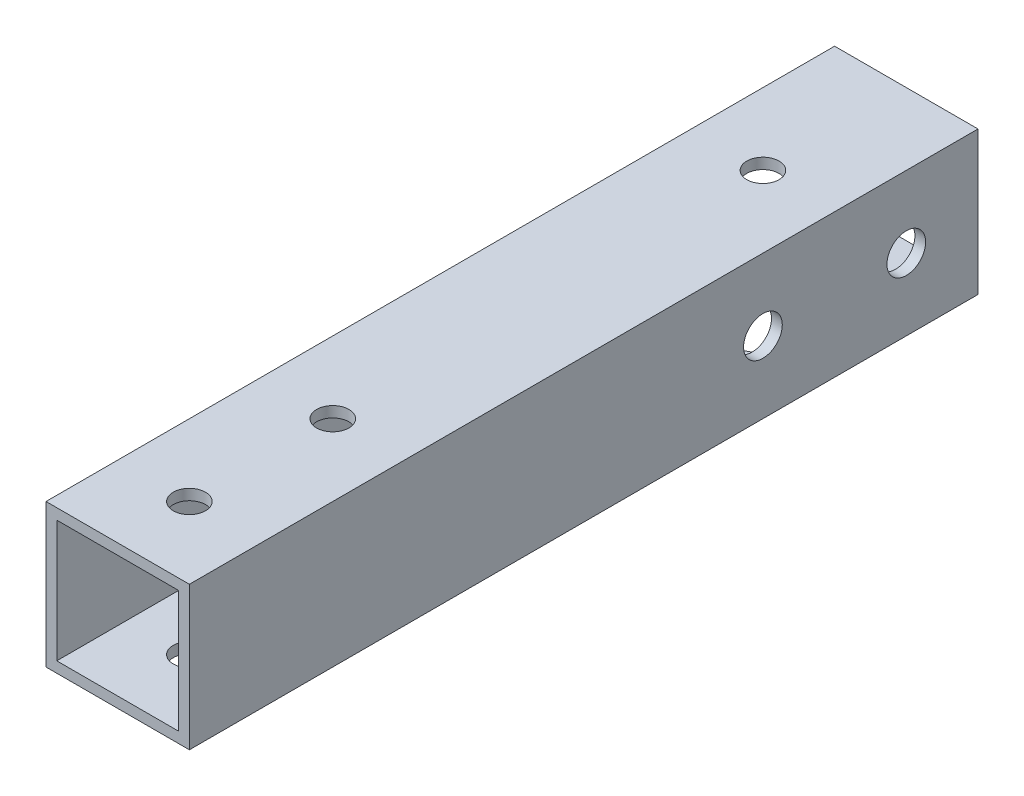
ISO-10303-21;
HEADER;
FILE_DESCRIPTION(('STEP AP214'),'2;1');
FILE_NAME('part.step','',(''),(''),'','','');
FILE_SCHEMA(('AUTOMOTIVE_DESIGN { 1 0 10303 214 1 1 1 1 }'));
ENDSEC;
DATA;
#1=APPLICATION_CONTEXT('core data for automotive mechanical design processes');
#2=APPLICATION_PROTOCOL_DEFINITION('international standard','automotive_design',2000,#1);
#3=PRODUCT_CONTEXT('',#1,'mechanical');
#4=PRODUCT('Part','Part','',(#3));
#5=PRODUCT_RELATED_PRODUCT_CATEGORY('part','',(#4));
#6=PRODUCT_DEFINITION_FORMATION('','',#4);
#7=PRODUCT_DEFINITION_CONTEXT('part definition',#1,'design');
#8=PRODUCT_DEFINITION('design','',#6,#7);
#9=PRODUCT_DEFINITION_SHAPE('','',#8);
#10=(LENGTH_UNIT() NAMED_UNIT(*) SI_UNIT(.MILLI.,.METRE.));
#11=(NAMED_UNIT(*) PLANE_ANGLE_UNIT() SI_UNIT($,.RADIAN.));
#12=(NAMED_UNIT(*) SI_UNIT($,.STERADIAN.) SOLID_ANGLE_UNIT());
#13=UNCERTAINTY_MEASURE_WITH_UNIT(LENGTH_MEASURE(1.E-05),#10,'distance_accuracy_value','');
#14=(GEOMETRIC_REPRESENTATION_CONTEXT(3) GLOBAL_UNCERTAINTY_ASSIGNED_CONTEXT((#13)) GLOBAL_UNIT_ASSIGNED_CONTEXT((#10,
#11,#12)) REPRESENTATION_CONTEXT('',''));
#15=CARTESIAN_POINT('',(0.,0.,0.));
#16=DIRECTION('',(0.,0.,1.));
#17=DIRECTION('',(1.,0.,0.));
#18=AXIS2_PLACEMENT_3D('',#15,#16,#17);
#19=CARTESIAN_POINT('',(0.,0.,110.));
#20=DIRECTION('',(0.,0.,-1.));
#21=DIRECTION('',(-1.,0.,0.));
#22=AXIS2_PLACEMENT_3D('',#19,#20,#21);
#23=PLANE('',#22);
#24=DIRECTION('',(0.,1.,0.));
#25=VECTOR('',#24,1.);
#26=CARTESIAN_POINT('',(10.,-10.,110.));
#27=LINE('',#26,#25);
#28=CARTESIAN_POINT('',(10.,-10.,110.));
#29=VERTEX_POINT('',#28);
#30=CARTESIAN_POINT('',(10.,10.,110.));
#31=VERTEX_POINT('',#30);
#32=EDGE_CURVE('E146',#29,#31,#27,.T.);
#33=ORIENTED_EDGE('',*,*,#32,.T.);
#34=DIRECTION('',(-1.,0.,0.));
#35=VECTOR('',#34,1.);
#36=CARTESIAN_POINT('',(-10.,10.,110.));
#37=LINE('',#36,#35);
#38=CARTESIAN_POINT('',(-10.,10.,110.));
#39=VERTEX_POINT('',#38);
#40=EDGE_CURVE('E149',#31,#39,#37,.T.);
#41=ORIENTED_EDGE('',*,*,#40,.T.);
#42=DIRECTION('',(0.,-1.,0.));
#43=VECTOR('',#42,1.);
#44=CARTESIAN_POINT('',(-10.,-10.,110.));
#45=LINE('',#44,#43);
#46=CARTESIAN_POINT('',(-10.,-10.,110.));
#47=VERTEX_POINT('',#46);
#48=EDGE_CURVE('E152',#39,#47,#45,.T.);
#49=ORIENTED_EDGE('',*,*,#48,.T.);
#50=DIRECTION('',(1.,0.,0.));
#51=VECTOR('',#50,1.);
#52=CARTESIAN_POINT('',(-10.,-10.,110.));
#53=LINE('',#52,#51);
#54=EDGE_CURVE('E154',#47,#29,#53,.T.);
#55=ORIENTED_EDGE('',*,*,#54,.T.);
#56=EDGE_LOOP('',(#33,#41,#49,#55));
#57=FACE_BOUND('',#56,.T.);
#58=DIRECTION('',(0.,1.,0.));
#59=VECTOR('',#58,1.);
#60=CARTESIAN_POINT('',(8.5,-8.5,110.));
#61=LINE('',#60,#59);
#62=CARTESIAN_POINT('',(8.5,-8.5,110.));
#63=VERTEX_POINT('',#62);
#64=CARTESIAN_POINT('',(8.5,8.5,110.));
#65=VERTEX_POINT('',#64);
#66=EDGE_CURVE('E108',#63,#65,#61,.T.);
#67=ORIENTED_EDGE('',*,*,#66,.F.);
#68=DIRECTION('',(1.,0.,0.));
#69=VECTOR('',#68,1.);
#70=CARTESIAN_POINT('',(-8.5,-8.5,110.));
#71=LINE('',#70,#69);
#72=CARTESIAN_POINT('',(-8.5,-8.5,110.));
#73=VERTEX_POINT('',#72);
#74=EDGE_CURVE('E130',#73,#63,#71,.T.);
#75=ORIENTED_EDGE('',*,*,#74,.F.);
#76=DIRECTION('',(0.,-1.,0.));
#77=VECTOR('',#76,1.);
#78=CARTESIAN_POINT('',(-8.5,-8.5,110.));
#79=LINE('',#78,#77);
#80=CARTESIAN_POINT('',(-8.5,8.5,110.));
#81=VERTEX_POINT('',#80);
#82=EDGE_CURVE('E128',#81,#73,#79,.T.);
#83=ORIENTED_EDGE('',*,*,#82,.F.);
#84=DIRECTION('',(-1.,0.,0.));
#85=VECTOR('',#84,1.);
#86=CARTESIAN_POINT('',(-8.5,8.5,110.));
#87=LINE('',#86,#85);
#88=EDGE_CURVE('E116',#65,#81,#87,.T.);
#89=ORIENTED_EDGE('',*,*,#88,.F.);
#90=EDGE_LOOP('',(#67,#75,#83,#89));
#91=FACE_BOUND('',#90,.T.);
#92=ADVANCED_FACE('F41',(#57,#91),#23,.F.);
#93=CARTESIAN_POINT('',(0.,0.,0.));
#94=DIRECTION('',(0.,0.,-1.));
#95=DIRECTION('',(-1.,0.,0.));
#96=AXIS2_PLACEMENT_3D('',#93,#94,#95);
#97=PLANE('',#96);
#98=DIRECTION('',(0.,1.,0.));
#99=VECTOR('',#98,1.);
#100=CARTESIAN_POINT('',(10.,-10.,0.));
#101=LINE('',#100,#99);
#102=CARTESIAN_POINT('',(10.,-10.,0.));
#103=VERTEX_POINT('',#102);
#104=CARTESIAN_POINT('',(10.,10.,0.));
#105=VERTEX_POINT('',#104);
#106=EDGE_CURVE('E124',#103,#105,#101,.T.);
#107=ORIENTED_EDGE('',*,*,#106,.F.);
#108=DIRECTION('',(1.,0.,0.));
#109=VECTOR('',#108,1.);
#110=CARTESIAN_POINT('',(-10.,-10.,0.));
#111=LINE('',#110,#109);
#112=CARTESIAN_POINT('',(-10.,-10.,0.));
#113=VERTEX_POINT('',#112);
#114=EDGE_CURVE('E150',#113,#103,#111,.T.);
#115=ORIENTED_EDGE('',*,*,#114,.F.);
#116=DIRECTION('',(0.,-1.,0.));
#117=VECTOR('',#116,1.);
#118=CARTESIAN_POINT('',(-10.,-10.,0.));
#119=LINE('',#118,#117);
#120=CARTESIAN_POINT('',(-10.,10.,0.));
#121=VERTEX_POINT('',#120);
#122=EDGE_CURVE('E161',#121,#113,#119,.T.);
#123=ORIENTED_EDGE('',*,*,#122,.F.);
#124=DIRECTION('',(-1.,0.,0.));
#125=VECTOR('',#124,1.);
#126=CARTESIAN_POINT('',(-10.,10.,0.));
#127=LINE('',#126,#125);
#128=EDGE_CURVE('E159',#105,#121,#127,.T.);
#129=ORIENTED_EDGE('',*,*,#128,.F.);
#130=EDGE_LOOP('',(#107,#115,#123,#129));
#131=FACE_BOUND('',#130,.T.);
#132=DIRECTION('',(1.,0.,0.));
#133=VECTOR('',#132,1.);
#134=CARTESIAN_POINT('',(-8.5,-8.5,0.));
#135=LINE('',#134,#133);
#136=CARTESIAN_POINT('',(-8.5,-8.5,0.));
#137=VERTEX_POINT('',#136);
#138=CARTESIAN_POINT('',(8.5,-8.5,0.));
#139=VERTEX_POINT('',#138);
#140=EDGE_CURVE('E117',#137,#139,#135,.T.);
#141=ORIENTED_EDGE('',*,*,#140,.T.);
#142=DIRECTION('',(0.,1.,0.));
#143=VECTOR('',#142,1.);
#144=CARTESIAN_POINT('',(8.5,-8.5,0.));
#145=LINE('',#144,#143);
#146=CARTESIAN_POINT('',(8.5,8.5,0.));
#147=VERTEX_POINT('',#146);
#148=EDGE_CURVE('E66',#139,#147,#145,.T.);
#149=ORIENTED_EDGE('',*,*,#148,.T.);
#150=DIRECTION('',(-1.,0.,0.));
#151=VECTOR('',#150,1.);
#152=CARTESIAN_POINT('',(-8.5,8.5,0.));
#153=LINE('',#152,#151);
#154=CARTESIAN_POINT('',(-8.5,8.5,0.));
#155=VERTEX_POINT('',#154);
#156=EDGE_CURVE('E123',#147,#155,#153,.T.);
#157=ORIENTED_EDGE('',*,*,#156,.T.);
#158=DIRECTION('',(0.,-1.,0.));
#159=VECTOR('',#158,1.);
#160=CARTESIAN_POINT('',(-8.5,-8.5,0.));
#161=LINE('',#160,#159);
#162=EDGE_CURVE('E138',#155,#137,#161,.T.);
#163=ORIENTED_EDGE('',*,*,#162,.T.);
#164=EDGE_LOOP('',(#141,#149,#157,#163));
#165=FACE_BOUND('',#164,.T.);
#166=ADVANCED_FACE('F256',(#131,#165),#97,.T.);
#167=CARTESIAN_POINT('',(10.,-10.,110.));
#168=DIRECTION('',(-1.,0.,0.));
#169=DIRECTION('',(0.,0.,1.));
#170=AXIS2_PLACEMENT_3D('',#167,#168,#169);
#171=PLANE('',#170);
#172=CARTESIAN_POINT('',(10.,0.,10.));
#173=DIRECTION('',(1.,0.,0.));
#174=DIRECTION('',(0.,0.,-1.));
#175=AXIS2_PLACEMENT_3D('',#172,#173,#174);
#176=CIRCLE('',#175,2.7);
#177=CARTESIAN_POINT('',(10.,0.,7.3));
#178=VERTEX_POINT('',#177);
#179=EDGE_CURVE('E227',#178,#178,#176,.T.);
#180=ORIENTED_EDGE('',*,*,#179,.F.);
#181=EDGE_LOOP('',(#180));
#182=FACE_BOUND('',#181,.T.);
#183=CARTESIAN_POINT('',(10.,0.,30.));
#184=DIRECTION('',(1.,0.,0.));
#185=DIRECTION('',(0.,0.,-1.));
#186=AXIS2_PLACEMENT_3D('',#183,#184,#185);
#187=CIRCLE('',#186,2.7);
#188=CARTESIAN_POINT('',(10.,0.,27.3));
#189=VERTEX_POINT('',#188);
#190=EDGE_CURVE('E226',#189,#189,#187,.T.);
#191=ORIENTED_EDGE('',*,*,#190,.F.);
#192=EDGE_LOOP('',(#191));
#193=FACE_BOUND('',#192,.T.);
#194=ORIENTED_EDGE('',*,*,#106,.T.);
#195=DIRECTION('',(0.,0.,-1.));
#196=VECTOR('',#195,1.);
#197=CARTESIAN_POINT('',(10.,10.,110.));
#198=LINE('',#197,#196);
#199=EDGE_CURVE('E11',#31,#105,#198,.T.);
#200=ORIENTED_EDGE('',*,*,#199,.F.);
#201=ORIENTED_EDGE('',*,*,#32,.F.);
#202=DIRECTION('',(0.,0.,-1.));
#203=VECTOR('',#202,1.);
#204=CARTESIAN_POINT('',(10.,-10.,110.));
#205=LINE('',#204,#203);
#206=EDGE_CURVE('E156',#29,#103,#205,.T.);
#207=ORIENTED_EDGE('',*,*,#206,.T.);
#208=EDGE_LOOP('',(#194,#200,#201,#207));
#209=FACE_BOUND('',#208,.T.);
#210=ADVANCED_FACE('F43',(#182,#193,#209),#171,.F.);
#211=CARTESIAN_POINT('',(-10.,10.,110.));
#212=DIRECTION('',(0.,-1.,0.));
#213=DIRECTION('',(0.,0.,-1.));
#214=AXIS2_PLACEMENT_3D('',#211,#212,#213);
#215=PLANE('',#214);
#216=CARTESIAN_POINT('',(0.,10.,100.));
#217=DIRECTION('',(0.,1.,0.));
#218=DIRECTION('',(0.,0.,1.));
#219=AXIS2_PLACEMENT_3D('',#216,#217,#218);
#220=CIRCLE('',#219,2.25);
#221=CARTESIAN_POINT('',(0.,10.,102.25));
#222=VERTEX_POINT('',#221);
#223=EDGE_CURVE('E209',#222,#222,#220,.T.);
#224=ORIENTED_EDGE('',*,*,#223,.F.);
#225=EDGE_LOOP('',(#224));
#226=FACE_BOUND('',#225,.T.);
#227=CARTESIAN_POINT('',(0.,10.,80.));
#228=DIRECTION('',(0.,1.,0.));
#229=DIRECTION('',(0.,0.,1.));
#230=AXIS2_PLACEMENT_3D('',#227,#228,#229);
#231=CIRCLE('',#230,2.25);
#232=CARTESIAN_POINT('',(0.,10.,82.25));
#233=VERTEX_POINT('',#232);
#234=EDGE_CURVE('E212',#233,#233,#231,.T.);
#235=ORIENTED_EDGE('',*,*,#234,.F.);
#236=EDGE_LOOP('',(#235));
#237=FACE_BOUND('',#236,.T.);
#238=CARTESIAN_POINT('',(-2.06718869533235E-13,10.,20.));
#239=DIRECTION('',(0.,1.,0.));
#240=DIRECTION('',(0.,0.,1.));
#241=AXIS2_PLACEMENT_3D('',#238,#239,#240);
#242=CIRCLE('',#241,2.25);
#243=CARTESIAN_POINT('',(-2.06718869533235E-13,10.,22.25));
#244=VERTEX_POINT('',#243);
#245=EDGE_CURVE('E183',#244,#244,#242,.T.);
#246=ORIENTED_EDGE('',*,*,#245,.F.);
#247=EDGE_LOOP('',(#246));
#248=FACE_BOUND('',#247,.T.);
#249=ORIENTED_EDGE('',*,*,#128,.T.);
#250=DIRECTION('',(0.,0.,-1.));
#251=VECTOR('',#250,1.);
#252=CARTESIAN_POINT('',(-10.,10.,110.));
#253=LINE('',#252,#251);
#254=EDGE_CURVE('E50',#39,#121,#253,.T.);
#255=ORIENTED_EDGE('',*,*,#254,.F.);
#256=ORIENTED_EDGE('',*,*,#40,.F.);
#257=ORIENTED_EDGE('',*,*,#199,.T.);
#258=EDGE_LOOP('',(#249,#255,#256,#257));
#259=FACE_BOUND('',#258,.T.);
#260=ADVANCED_FACE('F255',(#226,#237,#248,#259),#215,.F.);
#261=CARTESIAN_POINT('',(-10.,-10.,110.));
#262=DIRECTION('',(1.,0.,0.));
#263=DIRECTION('',(0.,0.,-1.));
#264=AXIS2_PLACEMENT_3D('',#261,#262,#263);
#265=PLANE('',#264);
#266=CARTESIAN_POINT('',(-10.,0.,10.));
#267=DIRECTION('',(1.,0.,0.));
#268=DIRECTION('',(0.,0.,-1.));
#269=AXIS2_PLACEMENT_3D('',#266,#267,#268);
#270=CIRCLE('',#269,5.);
#271=CARTESIAN_POINT('',(-10.,0.,5.));
#272=VERTEX_POINT('',#271);
#273=EDGE_CURVE('E190',#272,#272,#270,.T.);
#274=ORIENTED_EDGE('',*,*,#273,.T.);
#275=EDGE_LOOP('',(#274));
#276=FACE_BOUND('',#275,.T.);
#277=CARTESIAN_POINT('',(-10.,0.,30.));
#278=DIRECTION('',(1.,0.,0.));
#279=DIRECTION('',(0.,0.,-1.));
#280=AXIS2_PLACEMENT_3D('',#277,#278,#279);
#281=CIRCLE('',#280,5.);
#282=CARTESIAN_POINT('',(-10.,0.,25.));
#283=VERTEX_POINT('',#282);
#284=EDGE_CURVE('E195',#283,#283,#281,.T.);
#285=ORIENTED_EDGE('',*,*,#284,.T.);
#286=EDGE_LOOP('',(#285));
#287=FACE_BOUND('',#286,.T.);
#288=ORIENTED_EDGE('',*,*,#122,.T.);
#289=DIRECTION('',(0.,0.,-1.));
#290=VECTOR('',#289,1.);
#291=CARTESIAN_POINT('',(-10.,-10.,110.));
#292=LINE('',#291,#290);
#293=EDGE_CURVE('E166',#47,#113,#292,.T.);
#294=ORIENTED_EDGE('',*,*,#293,.F.);
#295=ORIENTED_EDGE('',*,*,#48,.F.);
#296=ORIENTED_EDGE('',*,*,#254,.T.);
#297=EDGE_LOOP('',(#288,#294,#295,#296));
#298=FACE_BOUND('',#297,.T.);
#299=ADVANCED_FACE('F274',(#276,#287,#298),#265,.F.);
#300=CARTESIAN_POINT('',(-10.,-10.,110.));
#301=DIRECTION('',(0.,1.,0.));
#302=DIRECTION('',(0.,0.,1.));
#303=AXIS2_PLACEMENT_3D('',#300,#301,#302);
#304=PLANE('',#303);
#305=CARTESIAN_POINT('',(-5.38458166943201E-12,-10.,20.0000000000006));
#306=DIRECTION('',(0.,-1.,0.));
#307=DIRECTION('',(0.,0.,-1.));
#308=AXIS2_PLACEMENT_3D('',#305,#306,#307);
#309=CIRCLE('',#308,5.);
#310=CARTESIAN_POINT('',(-5.38458166943201E-12,-10.,15.0000000000006));
#311=VERTEX_POINT('',#310);
#312=EDGE_CURVE('E187',#311,#311,#309,.T.);
#313=ORIENTED_EDGE('',*,*,#312,.F.);
#314=EDGE_LOOP('',(#313));
#315=FACE_BOUND('',#314,.T.);
#316=CARTESIAN_POINT('',(0.,-10.,7.5));
#317=DIRECTION('',(0.,-1.,0.));
#318=DIRECTION('',(0.,0.,-1.));
#319=AXIS2_PLACEMENT_3D('',#316,#317,#318);
#320=CIRCLE('',#319,2.25);
#321=CARTESIAN_POINT('',(0.,-10.,5.25));
#322=VERTEX_POINT('',#321);
#323=EDGE_CURVE('E184',#322,#322,#320,.T.);
#324=ORIENTED_EDGE('',*,*,#323,.F.);
#325=EDGE_LOOP('',(#324));
#326=FACE_BOUND('',#325,.T.);
#327=CARTESIAN_POINT('',(0.,-10.,100.));
#328=DIRECTION('',(0.,1.,0.));
#329=DIRECTION('',(0.,0.,1.));
#330=AXIS2_PLACEMENT_3D('',#327,#328,#329);
#331=CIRCLE('',#330,2.25);
#332=CARTESIAN_POINT('',(0.,-10.,102.25));
#333=VERTEX_POINT('',#332);
#334=EDGE_CURVE('E206',#333,#333,#331,.T.);
#335=ORIENTED_EDGE('',*,*,#334,.T.);
#336=EDGE_LOOP('',(#335));
#337=FACE_BOUND('',#336,.T.);
#338=CARTESIAN_POINT('',(0.,-10.,80.));
#339=DIRECTION('',(0.,1.,0.));
#340=DIRECTION('',(0.,0.,1.));
#341=AXIS2_PLACEMENT_3D('',#338,#339,#340);
#342=CIRCLE('',#341,2.25);
#343=CARTESIAN_POINT('',(0.,-10.,82.25));
#344=VERTEX_POINT('',#343);
#345=EDGE_CURVE('E215',#344,#344,#342,.T.);
#346=ORIENTED_EDGE('',*,*,#345,.T.);
#347=EDGE_LOOP('',(#346));
#348=FACE_BOUND('',#347,.T.);
#349=ORIENTED_EDGE('',*,*,#114,.T.);
#350=ORIENTED_EDGE('',*,*,#206,.F.);
#351=ORIENTED_EDGE('',*,*,#54,.F.);
#352=ORIENTED_EDGE('',*,*,#293,.T.);
#353=EDGE_LOOP('',(#349,#350,#351,#352));
#354=FACE_BOUND('',#353,.T.);
#355=ADVANCED_FACE('F242',(#315,#326,#337,#348,#354),#304,.F.);
#356=CARTESIAN_POINT('',(8.5,-8.5,110.));
#357=DIRECTION('',(-1.,0.,0.));
#358=DIRECTION('',(0.,0.,1.));
#359=AXIS2_PLACEMENT_3D('',#356,#357,#358);
#360=PLANE('',#359);
#361=CARTESIAN_POINT('',(8.5,0.,10.));
#362=DIRECTION('',(-1.,0.,0.));
#363=DIRECTION('',(0.,0.,1.));
#364=AXIS2_PLACEMENT_3D('',#361,#362,#363);
#365=CIRCLE('',#364,2.7);
#366=CARTESIAN_POINT('',(8.5,0.,12.7));
#367=VERTEX_POINT('',#366);
#368=EDGE_CURVE('E136',#367,#367,#365,.T.);
#369=ORIENTED_EDGE('',*,*,#368,.F.);
#370=EDGE_LOOP('',(#369));
#371=FACE_BOUND('',#370,.T.);
#372=CARTESIAN_POINT('',(8.5,0.,30.));
#373=DIRECTION('',(-1.,0.,0.));
#374=DIRECTION('',(0.,0.,1.));
#375=AXIS2_PLACEMENT_3D('',#372,#373,#374);
#376=CIRCLE('',#375,2.7);
#377=CARTESIAN_POINT('',(8.5,0.,32.7));
#378=VERTEX_POINT('',#377);
#379=EDGE_CURVE('E230',#378,#378,#376,.T.);
#380=ORIENTED_EDGE('',*,*,#379,.F.);
#381=EDGE_LOOP('',(#380));
#382=FACE_BOUND('',#381,.T.);
#383=ORIENTED_EDGE('',*,*,#148,.F.);
#384=DIRECTION('',(0.,0.,-1.));
#385=VECTOR('',#384,1.);
#386=CARTESIAN_POINT('',(8.5,-8.5,110.));
#387=LINE('',#386,#385);
#388=EDGE_CURVE('E112',#63,#139,#387,.T.);
#389=ORIENTED_EDGE('',*,*,#388,.F.);
#390=ORIENTED_EDGE('',*,*,#66,.T.);
#391=DIRECTION('',(0.,0.,-1.));
#392=VECTOR('',#391,1.);
#393=CARTESIAN_POINT('',(8.5,8.5,110.));
#394=LINE('',#393,#392);
#395=EDGE_CURVE('E111',#65,#147,#394,.T.);
#396=ORIENTED_EDGE('',*,*,#395,.T.);
#397=EDGE_LOOP('',(#383,#389,#390,#396));
#398=FACE_BOUND('',#397,.T.);
#399=ADVANCED_FACE('F110',(#371,#382,#398),#360,.T.);
#400=CARTESIAN_POINT('',(-8.5,8.5,110.));
#401=DIRECTION('',(0.,-1.,0.));
#402=DIRECTION('',(0.,0.,-1.));
#403=AXIS2_PLACEMENT_3D('',#400,#401,#402);
#404=PLANE('',#403);
#405=CARTESIAN_POINT('',(0.,8.5,100.));
#406=DIRECTION('',(0.,-1.,0.));
#407=DIRECTION('',(0.,0.,-1.));
#408=AXIS2_PLACEMENT_3D('',#405,#406,#407);
#409=CIRCLE('',#408,2.25);
#410=CARTESIAN_POINT('',(0.,8.5,97.75));
#411=VERTEX_POINT('',#410);
#412=EDGE_CURVE('E179',#411,#411,#409,.T.);
#413=ORIENTED_EDGE('',*,*,#412,.F.);
#414=EDGE_LOOP('',(#413));
#415=FACE_BOUND('',#414,.T.);
#416=CARTESIAN_POINT('',(0.,8.5,80.));
#417=DIRECTION('',(0.,-1.,0.));
#418=DIRECTION('',(0.,0.,-1.));
#419=AXIS2_PLACEMENT_3D('',#416,#417,#418);
#420=CIRCLE('',#419,2.25);
#421=CARTESIAN_POINT('',(0.,8.5,77.75));
#422=VERTEX_POINT('',#421);
#423=EDGE_CURVE('E174',#422,#422,#420,.T.);
#424=ORIENTED_EDGE('',*,*,#423,.F.);
#425=EDGE_LOOP('',(#424));
#426=FACE_BOUND('',#425,.T.);
#427=CARTESIAN_POINT('',(-2.06718869533235E-13,8.5,20.));
#428=DIRECTION('',(0.,-1.,0.));
#429=DIRECTION('',(0.,0.,-1.));
#430=AXIS2_PLACEMENT_3D('',#427,#428,#429);
#431=CIRCLE('',#430,2.25);
#432=CARTESIAN_POINT('',(-2.06718869533235E-13,8.5,17.75));
#433=VERTEX_POINT('',#432);
#434=EDGE_CURVE('E175',#433,#433,#431,.T.);
#435=ORIENTED_EDGE('',*,*,#434,.F.);
#436=EDGE_LOOP('',(#435));
#437=FACE_BOUND('',#436,.T.);
#438=ORIENTED_EDGE('',*,*,#156,.F.);
#439=ORIENTED_EDGE('',*,*,#395,.F.);
#440=ORIENTED_EDGE('',*,*,#88,.T.);
#441=DIRECTION('',(0.,0.,-1.));
#442=VECTOR('',#441,1.);
#443=CARTESIAN_POINT('',(-8.5,8.5,110.));
#444=LINE('',#443,#442);
#445=EDGE_CURVE('E125',#81,#155,#444,.T.);
#446=ORIENTED_EDGE('',*,*,#445,.T.);
#447=EDGE_LOOP('',(#438,#439,#440,#446));
#448=FACE_BOUND('',#447,.T.);
#449=ADVANCED_FACE('F120',(#415,#426,#437,#448),#404,.T.);
#450=CARTESIAN_POINT('',(-8.5,-8.5,110.));
#451=DIRECTION('',(1.,0.,0.));
#452=DIRECTION('',(0.,0.,-1.));
#453=AXIS2_PLACEMENT_3D('',#450,#451,#452);
#454=PLANE('',#453);
#455=CARTESIAN_POINT('',(-8.5,0.,10.));
#456=DIRECTION('',(1.,0.,0.));
#457=DIRECTION('',(0.,0.,-1.));
#458=AXIS2_PLACEMENT_3D('',#455,#456,#457);
#459=CIRCLE('',#458,5.);
#460=CARTESIAN_POINT('',(-8.5,0.,5.));
#461=VERTEX_POINT('',#460);
#462=EDGE_CURVE('E45',#461,#461,#459,.T.);
#463=ORIENTED_EDGE('',*,*,#462,.F.);
#464=EDGE_LOOP('',(#463));
#465=FACE_BOUND('',#464,.T.);
#466=CARTESIAN_POINT('',(-8.5,0.,30.));
#467=DIRECTION('',(1.,0.,0.));
#468=DIRECTION('',(0.,0.,-1.));
#469=AXIS2_PLACEMENT_3D('',#466,#467,#468);
#470=CIRCLE('',#469,5.);
#471=CARTESIAN_POINT('',(-8.5,0.,25.));
#472=VERTEX_POINT('',#471);
#473=EDGE_CURVE('E188',#472,#472,#470,.T.);
#474=ORIENTED_EDGE('',*,*,#473,.F.);
#475=EDGE_LOOP('',(#474));
#476=FACE_BOUND('',#475,.T.);
#477=ORIENTED_EDGE('',*,*,#162,.F.);
#478=ORIENTED_EDGE('',*,*,#445,.F.);
#479=ORIENTED_EDGE('',*,*,#82,.T.);
#480=DIRECTION('',(0.,0.,-1.));
#481=VECTOR('',#480,1.);
#482=CARTESIAN_POINT('',(-8.5,-8.5,110.));
#483=LINE('',#482,#481);
#484=EDGE_CURVE('E58',#73,#137,#483,.T.);
#485=ORIENTED_EDGE('',*,*,#484,.T.);
#486=EDGE_LOOP('',(#477,#478,#479,#485));
#487=FACE_BOUND('',#486,.T.);
#488=ADVANCED_FACE('F296',(#465,#476,#487),#454,.T.);
#489=CARTESIAN_POINT('',(-8.5,-8.5,110.));
#490=DIRECTION('',(0.,1.,0.));
#491=DIRECTION('',(0.,0.,1.));
#492=AXIS2_PLACEMENT_3D('',#489,#490,#491);
#493=PLANE('',#492);
#494=CARTESIAN_POINT('',(-5.38458166943201E-12,-8.5,20.0000000000006));
#495=DIRECTION('',(0.,1.,0.));
#496=DIRECTION('',(0.,0.,1.));
#497=AXIS2_PLACEMENT_3D('',#494,#495,#496);
#498=CIRCLE('',#497,5.);
#499=CARTESIAN_POINT('',(-5.38458166943201E-12,-8.5,25.0000000000006));
#500=VERTEX_POINT('',#499);
#501=EDGE_CURVE('E185',#500,#500,#498,.T.);
#502=ORIENTED_EDGE('',*,*,#501,.F.);
#503=EDGE_LOOP('',(#502));
#504=FACE_BOUND('',#503,.T.);
#505=CARTESIAN_POINT('',(0.,-8.5,7.5));
#506=DIRECTION('',(0.,1.,0.));
#507=DIRECTION('',(0.,0.,1.));
#508=AXIS2_PLACEMENT_3D('',#505,#506,#507);
#509=CIRCLE('',#508,2.25);
#510=CARTESIAN_POINT('',(0.,-8.5,9.75));
#511=VERTEX_POINT('',#510);
#512=EDGE_CURVE('E180',#511,#511,#509,.T.);
#513=ORIENTED_EDGE('',*,*,#512,.F.);
#514=EDGE_LOOP('',(#513));
#515=FACE_BOUND('',#514,.T.);
#516=CARTESIAN_POINT('',(0.,-8.5,100.));
#517=DIRECTION('',(0.,1.,0.));
#518=DIRECTION('',(0.,0.,1.));
#519=AXIS2_PLACEMENT_3D('',#516,#517,#518);
#520=CIRCLE('',#519,2.25);
#521=CARTESIAN_POINT('',(0.,-8.5,102.25));
#522=VERTEX_POINT('',#521);
#523=EDGE_CURVE('E176',#522,#522,#520,.T.);
#524=ORIENTED_EDGE('',*,*,#523,.F.);
#525=EDGE_LOOP('',(#524));
#526=FACE_BOUND('',#525,.T.);
#527=CARTESIAN_POINT('',(0.,-8.5,80.));
#528=DIRECTION('',(0.,1.,0.));
#529=DIRECTION('',(0.,0.,1.));
#530=AXIS2_PLACEMENT_3D('',#527,#528,#529);
#531=CIRCLE('',#530,2.25);
#532=CARTESIAN_POINT('',(0.,-8.5,82.25));
#533=VERTEX_POINT('',#532);
#534=EDGE_CURVE('E171',#533,#533,#531,.T.);
#535=ORIENTED_EDGE('',*,*,#534,.F.);
#536=EDGE_LOOP('',(#535));
#537=FACE_BOUND('',#536,.T.);
#538=ORIENTED_EDGE('',*,*,#140,.F.);
#539=ORIENTED_EDGE('',*,*,#484,.F.);
#540=ORIENTED_EDGE('',*,*,#74,.T.);
#541=ORIENTED_EDGE('',*,*,#388,.T.);
#542=EDGE_LOOP('',(#538,#539,#540,#541));
#543=FACE_BOUND('',#542,.T.);
#544=ADVANCED_FACE('F249',(#504,#515,#526,#537,#543),#493,.T.);
#545=CARTESIAN_POINT('',(-15.,0.,30.));
#546=DIRECTION('',(1.,0.,0.));
#547=DIRECTION('',(0.,0.,-1.));
#548=AXIS2_PLACEMENT_3D('',#545,#546,#547);
#549=CYLINDRICAL_SURFACE('',#548,2.7);
#550=ORIENTED_EDGE('',*,*,#379,.T.);
#551=EDGE_LOOP('',(#550));
#552=FACE_BOUND('',#551,.T.);
#553=ORIENTED_EDGE('',*,*,#190,.T.);
#554=EDGE_LOOP('',(#553));
#555=FACE_BOUND('',#554,.T.);
#556=ADVANCED_FACE('F246',(#552,#555),#549,.F.);
#557=CARTESIAN_POINT('',(-15.,0.,10.));
#558=DIRECTION('',(1.,0.,0.));
#559=DIRECTION('',(0.,0.,-1.));
#560=AXIS2_PLACEMENT_3D('',#557,#558,#559);
#561=CYLINDRICAL_SURFACE('',#560,2.7);
#562=ORIENTED_EDGE('',*,*,#368,.T.);
#563=EDGE_LOOP('',(#562));
#564=FACE_BOUND('',#563,.T.);
#565=ORIENTED_EDGE('',*,*,#179,.T.);
#566=EDGE_LOOP('',(#565));
#567=FACE_BOUND('',#566,.T.);
#568=ADVANCED_FACE('F237',(#564,#567),#561,.F.);
#569=CARTESIAN_POINT('',(0.,-10.,80.));
#570=DIRECTION('',(0.,1.,0.));
#571=DIRECTION('',(0.,0.,1.));
#572=AXIS2_PLACEMENT_3D('',#569,#570,#571);
#573=CYLINDRICAL_SURFACE('',#572,2.25);
#574=ORIENTED_EDGE('',*,*,#534,.T.);
#575=EDGE_LOOP('',(#574));
#576=FACE_BOUND('',#575,.T.);
#577=ORIENTED_EDGE('',*,*,#345,.F.);
#578=EDGE_LOOP('',(#577));
#579=FACE_BOUND('',#578,.T.);
#580=ADVANCED_FACE('F305',(#576,#579),#573,.F.);
#581=CARTESIAN_POINT('',(0.,-10.,100.));
#582=DIRECTION('',(0.,1.,0.));
#583=DIRECTION('',(0.,0.,1.));
#584=AXIS2_PLACEMENT_3D('',#581,#582,#583);
#585=CYLINDRICAL_SURFACE('',#584,2.25);
#586=ORIENTED_EDGE('',*,*,#523,.T.);
#587=EDGE_LOOP('',(#586));
#588=FACE_BOUND('',#587,.T.);
#589=ORIENTED_EDGE('',*,*,#334,.F.);
#590=EDGE_LOOP('',(#589));
#591=FACE_BOUND('',#590,.T.);
#592=ADVANCED_FACE('F310',(#588,#591),#585,.F.);
#593=CARTESIAN_POINT('',(-2.06718869533235E-13,-10.,20.));
#594=DIRECTION('',(0.,1.,0.));
#595=DIRECTION('',(0.,0.,1.));
#596=AXIS2_PLACEMENT_3D('',#593,#594,#595);
#597=CYLINDRICAL_SURFACE('',#596,2.25);
#598=ORIENTED_EDGE('',*,*,#434,.T.);
#599=EDGE_LOOP('',(#598));
#600=FACE_BOUND('',#599,.T.);
#601=ORIENTED_EDGE('',*,*,#245,.T.);
#602=EDGE_LOOP('',(#601));
#603=FACE_BOUND('',#602,.T.);
#604=ADVANCED_FACE('F306',(#600,#603),#597,.F.);
#605=ORIENTED_EDGE('',*,*,#423,.T.);
#606=EDGE_LOOP('',(#605));
#607=FACE_BOUND('',#606,.T.);
#608=ORIENTED_EDGE('',*,*,#234,.T.);
#609=EDGE_LOOP('',(#608));
#610=FACE_BOUND('',#609,.T.);
#611=ADVANCED_FACE('F309',(#607,#610),#573,.F.);
#612=ORIENTED_EDGE('',*,*,#412,.T.);
#613=EDGE_LOOP('',(#612));
#614=FACE_BOUND('',#613,.T.);
#615=ORIENTED_EDGE('',*,*,#223,.T.);
#616=EDGE_LOOP('',(#615));
#617=FACE_BOUND('',#616,.T.);
#618=ADVANCED_FACE('F318',(#614,#617),#585,.F.);
#619=CARTESIAN_POINT('',(0.,-5.,7.5));
#620=DIRECTION('',(0.,-1.,0.));
#621=DIRECTION('',(0.,0.,-1.));
#622=AXIS2_PLACEMENT_3D('',#619,#620,#621);
#623=CYLINDRICAL_SURFACE('',#622,2.25);
#624=ORIENTED_EDGE('',*,*,#512,.T.);
#625=EDGE_LOOP('',(#624));
#626=FACE_BOUND('',#625,.T.);
#627=ORIENTED_EDGE('',*,*,#323,.T.);
#628=EDGE_LOOP('',(#627));
#629=FACE_BOUND('',#628,.T.);
#630=ADVANCED_FACE('F319',(#626,#629),#623,.F.);
#631=CARTESIAN_POINT('',(-5.38458166943201E-12,0.,20.0000000000006));
#632=DIRECTION('',(0.,-1.,0.));
#633=DIRECTION('',(0.,0.,-1.));
#634=AXIS2_PLACEMENT_3D('',#631,#632,#633);
#635=CYLINDRICAL_SURFACE('',#634,5.);
#636=ORIENTED_EDGE('',*,*,#501,.T.);
#637=EDGE_LOOP('',(#636));
#638=FACE_BOUND('',#637,.T.);
#639=ORIENTED_EDGE('',*,*,#312,.T.);
#640=EDGE_LOOP('',(#639));
#641=FACE_BOUND('',#640,.T.);
#642=ADVANCED_FACE('F322',(#638,#641),#635,.F.);
#643=CARTESIAN_POINT('',(-10.,0.,30.));
#644=DIRECTION('',(1.,0.,0.));
#645=DIRECTION('',(0.,0.,-1.));
#646=AXIS2_PLACEMENT_3D('',#643,#644,#645);
#647=CYLINDRICAL_SURFACE('',#646,5.);
#648=ORIENTED_EDGE('',*,*,#473,.T.);
#649=EDGE_LOOP('',(#648));
#650=FACE_BOUND('',#649,.T.);
#651=ORIENTED_EDGE('',*,*,#284,.F.);
#652=EDGE_LOOP('',(#651));
#653=FACE_BOUND('',#652,.T.);
#654=ADVANCED_FACE('F325',(#650,#653),#647,.F.);
#655=CARTESIAN_POINT('',(-10.,0.,10.));
#656=DIRECTION('',(1.,0.,0.));
#657=DIRECTION('',(0.,0.,-1.));
#658=AXIS2_PLACEMENT_3D('',#655,#656,#657);
#659=CYLINDRICAL_SURFACE('',#658,5.);
#660=ORIENTED_EDGE('',*,*,#462,.T.);
#661=EDGE_LOOP('',(#660));
#662=FACE_BOUND('',#661,.T.);
#663=ORIENTED_EDGE('',*,*,#273,.F.);
#664=EDGE_LOOP('',(#663));
#665=FACE_BOUND('',#664,.T.);
#666=ADVANCED_FACE('F329',(#662,#665),#659,.F.);
#667=CLOSED_SHELL('',(#92,#166,#210,#260,#299,#355,#399,#449,#488,#544,#556,#568,#580,#592,#604,
#611,#618,#630,#642,#654,#666));
#668=MANIFOLD_SOLID_BREP('B2',#667);
#669=ADVANCED_BREP_SHAPE_REPRESENTATION('',(#18,#668),#14);
#670=SHAPE_DEFINITION_REPRESENTATION(#9,#669);
ENDSEC;
END-ISO-10303-21;
